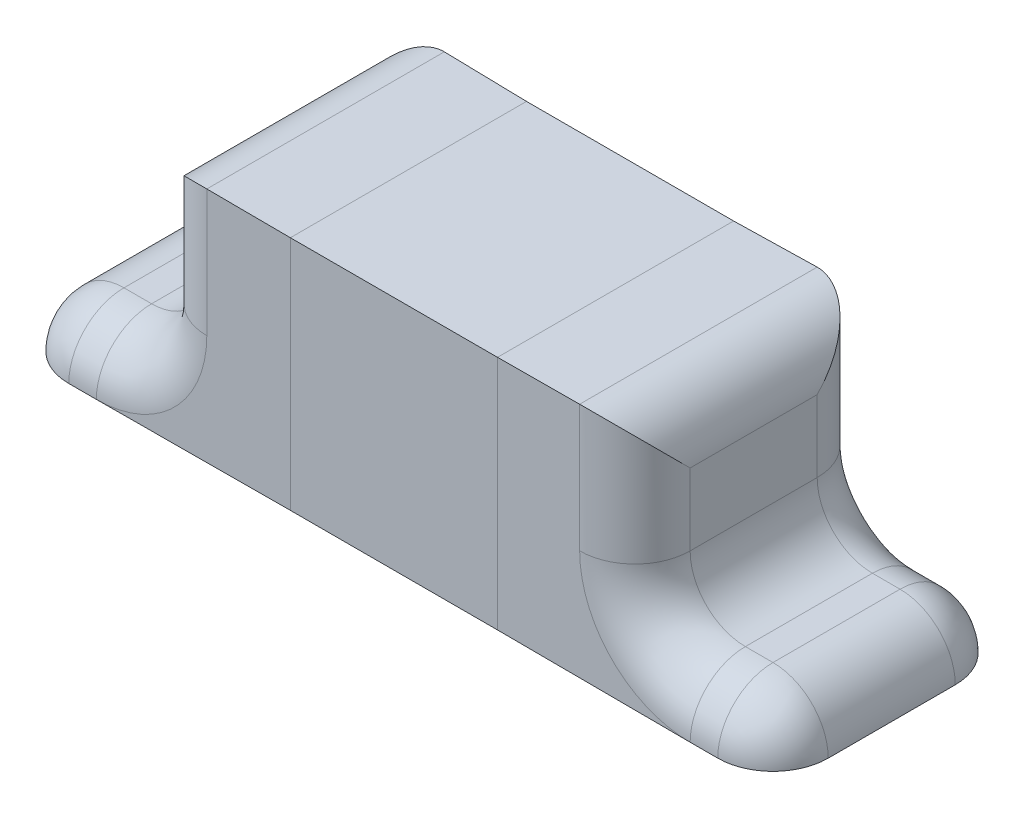
ISO-10303-21;
HEADER;
FILE_DESCRIPTION(('STEP AP214'),'2;1');
FILE_NAME('part.step','',(''),(''),'','','');
FILE_SCHEMA(('AUTOMOTIVE_DESIGN { 1 0 10303 214 1 1 1 1 }'));
ENDSEC;
DATA;
#1=APPLICATION_CONTEXT('core data for automotive mechanical design processes');
#2=APPLICATION_PROTOCOL_DEFINITION('international standard','automotive_design',2000,#1);
#3=PRODUCT_CONTEXT('',#1,'mechanical');
#4=PRODUCT('Part','Part','',(#3));
#5=PRODUCT_RELATED_PRODUCT_CATEGORY('part','',(#4));
#6=PRODUCT_DEFINITION_FORMATION('','',#4);
#7=PRODUCT_DEFINITION_CONTEXT('part definition',#1,'design');
#8=PRODUCT_DEFINITION('design','',#6,#7);
#9=PRODUCT_DEFINITION_SHAPE('','',#8);
#10=(LENGTH_UNIT() NAMED_UNIT(*) SI_UNIT(.MILLI.,.METRE.));
#11=(NAMED_UNIT(*) PLANE_ANGLE_UNIT() SI_UNIT($,.RADIAN.));
#12=(NAMED_UNIT(*) SI_UNIT($,.STERADIAN.) SOLID_ANGLE_UNIT());
#13=UNCERTAINTY_MEASURE_WITH_UNIT(LENGTH_MEASURE(1.E-05),#10,'distance_accuracy_value','');
#14=(GEOMETRIC_REPRESENTATION_CONTEXT(3) GLOBAL_UNCERTAINTY_ASSIGNED_CONTEXT((#13)) GLOBAL_UNIT_ASSIGNED_CONTEXT((#10,
#11,#12)) REPRESENTATION_CONTEXT('',''));
#15=CARTESIAN_POINT('',(0.,0.,0.));
#16=DIRECTION('',(0.,0.,1.));
#17=DIRECTION('',(1.,0.,0.));
#18=AXIS2_PLACEMENT_3D('',#15,#16,#17);
#19=CARTESIAN_POINT('',(0.875,0.,0.));
#20=DIRECTION('',(-1.,0.,0.));
#21=DIRECTION('',(0.,0.,1.));
#22=AXIS2_PLACEMENT_3D('',#19,#20,#21);
#23=PLANE('',#22);
#24=DIRECTION('',(0.,1.,0.));
#25=VECTOR('',#24,1.);
#26=CARTESIAN_POINT('',(0.875,0.,-0.23));
#27=LINE('',#26,#25);
#28=CARTESIAN_POINT('',(0.875,0.398442990090282,-0.23));
#29=VERTEX_POINT('',#28);
#30=CARTESIAN_POINT('',(0.875,0.658442990090282,-0.23));
#31=VERTEX_POINT('',#30);
#32=EDGE_CURVE('E899',#29,#31,#27,.T.);
#33=ORIENTED_EDGE('',*,*,#32,.T.);
#34=DIRECTION('',(0.,0.,1.));
#35=VECTOR('',#34,1.);
#36=CARTESIAN_POINT('',(0.875,0.658442990090282,0.));
#37=LINE('',#36,#35);
#38=CARTESIAN_POINT('',(0.875,0.658442990090282,0.23));
#39=VERTEX_POINT('',#38);
#40=EDGE_CURVE('E457',#31,#39,#37,.T.);
#41=ORIENTED_EDGE('',*,*,#40,.T.);
#42=DIRECTION('',(0.,-1.,0.));
#43=VECTOR('',#42,1.);
#44=CARTESIAN_POINT('',(0.875,0.,0.23));
#45=LINE('',#44,#43);
#46=CARTESIAN_POINT('',(0.875,0.398442990090282,0.23));
#47=VERTEX_POINT('',#46);
#48=EDGE_CURVE('E921',#39,#47,#45,.T.);
#49=ORIENTED_EDGE('',*,*,#48,.T.);
#50=DIRECTION('',(0.,0.,1.));
#51=VECTOR('',#50,1.);
#52=CARTESIAN_POINT('',(0.875,0.398442990090282,-0.43));
#53=LINE('',#52,#51);
#54=EDGE_CURVE('E252',#47,#29,#53,.F.);
#55=ORIENTED_EDGE('',*,*,#54,.T.);
#56=EDGE_LOOP('',(#33,#41,#49,#55));
#57=FACE_BOUND('',#56,.T.);
#58=ADVANCED_FACE('F41',(#57),#23,.F.);
#59=CARTESIAN_POINT('',(0.375,0.,-0.425));
#60=DIRECTION('',(0.,0.,1.));
#61=DIRECTION('',(1.,0.,0.));
#62=AXIS2_PLACEMENT_3D('',#59,#60,#61);
#63=PLANE('',#62);
#64=CARTESIAN_POINT('',(-0.375,0.,-0.425));
#65=DIRECTION('',(0.,1.,0.));
#66=VECTOR('',#65,1.);
#67=LINE('',#64,#66);
#68=CARTESIAN_POINT('',(-0.375,-0.000778504954858498,-0.4275));
#69=VERTEX_POINT('',#68);
#70=CARTESIAN_POINT('',(-0.375,0.854221495045141,-0.4275));
#71=VERTEX_POINT('',#70);
#72=EDGE_CURVE('E204',#69,#71,#67,.T.);
#73=ORIENTED_EDGE('',*,*,#72,.T.);
#74=DIRECTION('',(-1.,0.,0.));
#75=VECTOR('',#74,1.);
#76=CARTESIAN_POINT('',(0.375,0.850000000000001,-0.425));
#77=LINE('',#76,#75);
#78=CARTESIAN_POINT('',(0.375,0.854221495045141,-0.4275));
#79=VERTEX_POINT('',#78);
#80=EDGE_CURVE('E249',#79,#71,#77,.T.);
#81=ORIENTED_EDGE('',*,*,#80,.F.);
#82=CARTESIAN_POINT('',(0.375,-0.00155700990971792,-0.43));
#83=DIRECTION('',(0.,1.,0.));
#84=VECTOR('',#83,1.);
#85=LINE('',#82,#84);
#86=CARTESIAN_POINT('',(0.375,-0.000778504954858498,-0.4275));
#87=VERTEX_POINT('',#86);
#88=EDGE_CURVE('E229',#87,#79,#85,.T.);
#89=ORIENTED_EDGE('',*,*,#88,.F.);
#90=DIRECTION('',(-1.,0.,0.));
#91=VECTOR('',#90,1.);
#92=CARTESIAN_POINT('',(0.375,0.,-0.425));
#93=LINE('',#92,#91);
#94=EDGE_CURVE('E225',#87,#69,#93,.T.);
#95=ORIENTED_EDGE('',*,*,#94,.T.);
#96=EDGE_LOOP('',(#73,#81,#89,#95));
#97=FACE_BOUND('',#96,.T.);
#98=ADVANCED_FACE('F234',(#97),#63,.F.);
#99=CARTESIAN_POINT('',(0.375,0.850000000000001,0.425));
#100=DIRECTION('',(0.,-1.,0.));
#101=DIRECTION('',(0.,0.,-1.));
#102=AXIS2_PLACEMENT_3D('',#99,#100,#101);
#103=PLANE('',#102);
#104=CARTESIAN_POINT('',(-0.375,0.850000000000001,-0.425));
#105=DIRECTION('',(0.,0.,1.));
#106=VECTOR('',#105,1.);
#107=LINE('',#104,#106);
#108=CARTESIAN_POINT('',(-0.375,0.854221495045141,0.4275));
#109=VERTEX_POINT('',#108);
#110=EDGE_CURVE('E215',#71,#109,#107,.T.);
#111=ORIENTED_EDGE('',*,*,#110,.T.);
#112=DIRECTION('',(-1.,0.,0.));
#113=VECTOR('',#112,1.);
#114=CARTESIAN_POINT('',(0.375,0.850000000000001,0.425));
#115=LINE('',#114,#113);
#116=CARTESIAN_POINT('',(0.375,0.854221495045141,0.4275));
#117=VERTEX_POINT('',#116);
#118=EDGE_CURVE('E239',#117,#109,#115,.T.);
#119=ORIENTED_EDGE('',*,*,#118,.F.);
#120=CARTESIAN_POINT('',(0.375,0.858442990090282,-0.43));
#121=DIRECTION('',(0.,0.,1.));
#122=VECTOR('',#121,1.);
#123=LINE('',#120,#122);
#124=EDGE_CURVE('E260',#79,#117,#123,.T.);
#125=ORIENTED_EDGE('',*,*,#124,.F.);
#126=ORIENTED_EDGE('',*,*,#80,.T.);
#127=EDGE_LOOP('',(#111,#119,#125,#126));
#128=FACE_BOUND('',#127,.T.);
#129=ADVANCED_FACE('F266',(#128),#103,.F.);
#130=CARTESIAN_POINT('',(0.375,0.,0.425));
#131=DIRECTION('',(0.,0.,-1.));
#132=DIRECTION('',(-1.,0.,0.));
#133=AXIS2_PLACEMENT_3D('',#130,#131,#132);
#134=PLANE('',#133);
#135=CARTESIAN_POINT('',(-0.375,0.850000000000001,0.425));
#136=DIRECTION('',(0.,-1.,0.));
#137=VECTOR('',#136,1.);
#138=LINE('',#135,#137);
#139=CARTESIAN_POINT('',(-0.375,-0.000778504954858524,0.4275));
#140=VERTEX_POINT('',#139);
#141=EDGE_CURVE('E230',#109,#140,#138,.T.);
#142=ORIENTED_EDGE('',*,*,#141,.T.);
#143=DIRECTION('',(-1.,0.,0.));
#144=VECTOR('',#143,1.);
#145=CARTESIAN_POINT('',(0.375,0.,0.425));
#146=LINE('',#145,#144);
#147=CARTESIAN_POINT('',(0.375,-0.000778504954858524,0.4275));
#148=VERTEX_POINT('',#147);
#149=EDGE_CURVE('E228',#148,#140,#146,.T.);
#150=ORIENTED_EDGE('',*,*,#149,.F.);
#151=CARTESIAN_POINT('',(0.375,0.858442990090282,0.43));
#152=DIRECTION('',(0.,-1.,0.));
#153=VECTOR('',#152,1.);
#154=LINE('',#151,#153);
#155=EDGE_CURVE('E241',#117,#148,#154,.T.);
#156=ORIENTED_EDGE('',*,*,#155,.F.);
#157=ORIENTED_EDGE('',*,*,#118,.T.);
#158=EDGE_LOOP('',(#142,#150,#156,#157));
#159=FACE_BOUND('',#158,.T.);
#160=ADVANCED_FACE('F275',(#159),#134,.F.);
#161=CARTESIAN_POINT('',(0.375,0.,0.425));
#162=DIRECTION('',(0.,1.,0.));
#163=DIRECTION('',(0.,0.,1.));
#164=AXIS2_PLACEMENT_3D('',#161,#162,#163);
#165=PLANE('',#164);
#166=CARTESIAN_POINT('',(-0.375,0.,0.425));
#167=DIRECTION('',(0.,0.,-1.));
#168=VECTOR('',#167,1.);
#169=LINE('',#166,#168);
#170=EDGE_CURVE('E194',#140,#69,#169,.T.);
#171=ORIENTED_EDGE('',*,*,#170,.T.);
#172=ORIENTED_EDGE('',*,*,#94,.F.);
#173=CARTESIAN_POINT('',(0.375,-0.00155700990971797,0.43));
#174=DIRECTION('',(0.,0.,-1.));
#175=VECTOR('',#174,1.);
#176=LINE('',#173,#175);
#177=EDGE_CURVE('E237',#148,#87,#176,.T.);
#178=ORIENTED_EDGE('',*,*,#177,.F.);
#179=ORIENTED_EDGE('',*,*,#149,.T.);
#180=EDGE_LOOP('',(#171,#172,#178,#179));
#181=FACE_BOUND('',#180,.T.);
#182=ADVANCED_FACE('F223',(#181),#165,.F.);
#183=CARTESIAN_POINT('',(0.875,-0.00155700990971792,-0.43));
#184=DIRECTION('',(0.,0.,1.));
#185=DIRECTION('',(1.,0.,0.));
#186=AXIS2_PLACEMENT_3D('',#183,#184,#185);
#187=PLANE('',#186);
#188=DIRECTION('',(-1.,0.,0.));
#189=VECTOR('',#188,1.);
#190=CARTESIAN_POINT('',(0.875,0.858442990090282,-0.43));
#191=LINE('',#190,#189);
#192=CARTESIAN_POINT('',(0.675,0.858442990090282,-0.43));
#193=VERTEX_POINT('',#192);
#194=EDGE_CURVE('E216',#193,#79,#191,.T.);
#195=ORIENTED_EDGE('',*,*,#194,.F.);
#196=DIRECTION('',(0.,1.,0.));
#197=VECTOR('',#196,1.);
#198=CARTESIAN_POINT('',(0.675,-0.00155700990971792,-0.43));
#199=LINE('',#198,#197);
#200=CARTESIAN_POINT('',(0.675,0.398442990090282,-0.43));
#201=VERTEX_POINT('',#200);
#202=EDGE_CURVE('E456',#193,#201,#199,.F.);
#203=ORIENTED_EDGE('',*,*,#202,.T.);
#204=CARTESIAN_POINT('',(1.075,0.398442990090282,-0.43));
#205=DIRECTION('',(0.,0.,1.));
#206=DIRECTION('',(1.,0.,0.));
#207=AXIS2_PLACEMENT_3D('',#204,#205,#206);
#208=CIRCLE('',#207,0.4);
#209=CARTESIAN_POINT('',(1.075,-0.00155700990971792,-0.43));
#210=VERTEX_POINT('',#209);
#211=EDGE_CURVE('E453',#210,#201,#208,.F.);
#212=ORIENTED_EDGE('',*,*,#211,.F.);
#213=DIRECTION('',(-1.,0.,0.));
#214=VECTOR('',#213,1.);
#215=CARTESIAN_POINT('',(0.875,-0.00155700990971792,-0.43));
#216=LINE('',#215,#214);
#217=EDGE_CURVE('E448',#210,#87,#216,.T.);
#218=ORIENTED_EDGE('',*,*,#217,.T.);
#219=ORIENTED_EDGE('',*,*,#88,.T.);
#220=EDGE_LOOP('',(#195,#203,#212,#218,#219));
#221=FACE_BOUND('',#220,.T.);
#222=ADVANCED_FACE('F424',(#221),#187,.F.);
#223=CARTESIAN_POINT('',(0.875,0.858442990090282,0.43));
#224=DIRECTION('',(0.,-1.,0.));
#225=DIRECTION('',(0.,0.,-1.));
#226=AXIS2_PLACEMENT_3D('',#223,#224,#225);
#227=PLANE('',#226);
#228=DIRECTION('',(-1.,0.,0.));
#229=VECTOR('',#228,1.);
#230=CARTESIAN_POINT('',(0.875,0.858442990090282,0.43));
#231=LINE('',#230,#229);
#232=CARTESIAN_POINT('',(0.675,0.858442990090282,0.43));
#233=VERTEX_POINT('',#232);
#234=EDGE_CURVE('E402',#233,#117,#231,.T.);
#235=ORIENTED_EDGE('',*,*,#234,.F.);
#236=DIRECTION('',(0.,0.,1.));
#237=VECTOR('',#236,1.);
#238=CARTESIAN_POINT('',(0.675,0.858442990090282,0.43));
#239=LINE('',#238,#237);
#240=EDGE_CURVE('E914',#233,#193,#239,.F.);
#241=ORIENTED_EDGE('',*,*,#240,.T.);
#242=ORIENTED_EDGE('',*,*,#194,.T.);
#243=ORIENTED_EDGE('',*,*,#124,.T.);
#244=EDGE_LOOP('',(#235,#241,#242,#243));
#245=FACE_BOUND('',#244,.T.);
#246=ADVANCED_FACE('F401',(#245),#227,.F.);
#247=CARTESIAN_POINT('',(0.875,-0.00155700990971797,0.43));
#248=DIRECTION('',(0.,0.,-1.));
#249=DIRECTION('',(-1.,0.,0.));
#250=AXIS2_PLACEMENT_3D('',#247,#248,#249);
#251=PLANE('',#250);
#252=CARTESIAN_POINT('',(1.075,0.398442990090282,0.43));
#253=DIRECTION('',(0.,0.,-1.));
#254=DIRECTION('',(-1.,0.,0.));
#255=AXIS2_PLACEMENT_3D('',#252,#253,#254);
#256=CIRCLE('',#255,0.4);
#257=CARTESIAN_POINT('',(0.675,0.398442990090282,0.43));
#258=VERTEX_POINT('',#257);
#259=CARTESIAN_POINT('',(1.075,-0.00155700990971797,0.43));
#260=VERTEX_POINT('',#259);
#261=EDGE_CURVE('E460',#258,#260,#256,.F.);
#262=ORIENTED_EDGE('',*,*,#261,.F.);
#263=DIRECTION('',(0.,-1.,0.));
#264=VECTOR('',#263,1.);
#265=CARTESIAN_POINT('',(0.675,-0.00155700990971797,0.43));
#266=LINE('',#265,#264);
#267=EDGE_CURVE('E916',#258,#233,#266,.F.);
#268=ORIENTED_EDGE('',*,*,#267,.T.);
#269=ORIENTED_EDGE('',*,*,#234,.T.);
#270=ORIENTED_EDGE('',*,*,#155,.T.);
#271=DIRECTION('',(-1.,0.,0.));
#272=VECTOR('',#271,1.);
#273=CARTESIAN_POINT('',(0.875,-0.00155700990971797,0.43));
#274=LINE('',#273,#272);
#275=EDGE_CURVE('E461',#260,#148,#274,.T.);
#276=ORIENTED_EDGE('',*,*,#275,.F.);
#277=EDGE_LOOP('',(#262,#268,#269,#270,#276));
#278=FACE_BOUND('',#277,.T.);
#279=ADVANCED_FACE('F423',(#278),#251,.F.);
#280=CARTESIAN_POINT('',(0.875,-0.00155700990971797,0.43));
#281=DIRECTION('',(0.,1.,0.));
#282=DIRECTION('',(0.,0.,1.));
#283=AXIS2_PLACEMENT_3D('',#280,#281,#282);
#284=PLANE('',#283);
#285=CARTESIAN_POINT('',(1.175,-0.00155700990971792,-0.43));
#286=VERTEX_POINT('',#285);
#287=EDGE_CURVE('E444',#286,#210,#216,.T.);
#288=ORIENTED_EDGE('',*,*,#287,.F.);
#289=CARTESIAN_POINT('',(1.175,-0.00155700990971793,-0.23));
#290=DIRECTION('',(0.,1.,0.));
#291=DIRECTION('',(0.,0.,1.));
#292=AXIS2_PLACEMENT_3D('',#289,#290,#291);
#293=CIRCLE('',#292,0.2);
#294=CARTESIAN_POINT('',(1.375,-0.00155700990971797,-0.23));
#295=VERTEX_POINT('',#294);
#296=EDGE_CURVE('E478',#286,#295,#293,.F.);
#297=ORIENTED_EDGE('',*,*,#296,.T.);
#298=DIRECTION('',(0.,0.,-1.));
#299=VECTOR('',#298,1.);
#300=CARTESIAN_POINT('',(1.375,-0.00155700990971797,0.43));
#301=LINE('',#300,#299);
#302=CARTESIAN_POINT('',(1.375,-0.00155700990971797,0.23));
#303=VERTEX_POINT('',#302);
#304=EDGE_CURVE('E451',#303,#295,#301,.T.);
#305=ORIENTED_EDGE('',*,*,#304,.F.);
#306=CARTESIAN_POINT('',(1.175,-0.00155700990971796,0.23));
#307=DIRECTION('',(0.,1.,0.));
#308=DIRECTION('',(0.,0.,1.));
#309=AXIS2_PLACEMENT_3D('',#306,#307,#308);
#310=CIRCLE('',#309,0.2);
#311=CARTESIAN_POINT('',(1.175,-0.00155700990971797,0.43));
#312=VERTEX_POINT('',#311);
#313=EDGE_CURVE('E476',#303,#312,#310,.F.);
#314=ORIENTED_EDGE('',*,*,#313,.T.);
#315=EDGE_CURVE('E464',#312,#260,#274,.T.);
#316=ORIENTED_EDGE('',*,*,#315,.T.);
#317=ORIENTED_EDGE('',*,*,#275,.T.);
#318=ORIENTED_EDGE('',*,*,#177,.T.);
#319=ORIENTED_EDGE('',*,*,#217,.F.);
#320=EDGE_LOOP('',(#288,#297,#305,#314,#316,#317,#318,#319));
#321=FACE_BOUND('',#320,.T.);
#322=ADVANCED_FACE('F548',(#321),#284,.F.);
#323=CARTESIAN_POINT('',(1.375,0.198442990090282,0.43));
#324=DIRECTION('',(0.,-1.,0.));
#325=DIRECTION('',(0.,0.,-1.));
#326=AXIS2_PLACEMENT_3D('',#323,#324,#325);
#327=PLANE('',#326);
#328=DIRECTION('',(-1.,0.,0.));
#329=VECTOR('',#328,1.);
#330=CARTESIAN_POINT('',(1.375,0.198442990090282,-0.23));
#331=LINE('',#330,#329);
#332=CARTESIAN_POINT('',(1.175,0.198442990090282,-0.23));
#333=VERTEX_POINT('',#332);
#334=CARTESIAN_POINT('',(1.075,0.198442990090282,-0.23));
#335=VERTEX_POINT('',#334);
#336=EDGE_CURVE('E906',#333,#335,#331,.T.);
#337=ORIENTED_EDGE('',*,*,#336,.T.);
#338=DIRECTION('',(0.,0.,1.));
#339=VECTOR('',#338,1.);
#340=CARTESIAN_POINT('',(1.075,0.198442990090282,0.43));
#341=LINE('',#340,#339);
#342=CARTESIAN_POINT('',(1.075,0.198442990090282,0.23));
#343=VERTEX_POINT('',#342);
#344=EDGE_CURVE('E904',#335,#343,#341,.T.);
#345=ORIENTED_EDGE('',*,*,#344,.T.);
#346=DIRECTION('',(-1.,0.,0.));
#347=VECTOR('',#346,1.);
#348=CARTESIAN_POINT('',(1.375,0.198442990090282,0.23));
#349=LINE('',#348,#347);
#350=CARTESIAN_POINT('',(1.175,0.198442990090282,0.23));
#351=VERTEX_POINT('',#350);
#352=EDGE_CURVE('E909',#343,#351,#349,.F.);
#353=ORIENTED_EDGE('',*,*,#352,.T.);
#354=DIRECTION('',(0.,0.,1.));
#355=VECTOR('',#354,1.);
#356=CARTESIAN_POINT('',(1.175,0.198442990090282,0.43));
#357=LINE('',#356,#355);
#358=EDGE_CURVE('E911',#351,#333,#357,.F.);
#359=ORIENTED_EDGE('',*,*,#358,.T.);
#360=EDGE_LOOP('',(#337,#345,#353,#359));
#361=FACE_BOUND('',#360,.T.);
#362=ADVANCED_FACE('F547',(#361),#327,.F.);
#363=CARTESIAN_POINT('',(0.875,-0.00155700990971797,0.23));
#364=DIRECTION('',(-1.,0.,0.));
#365=DIRECTION('',(0.,0.,1.));
#366=AXIS2_PLACEMENT_3D('',#363,#364,#365);
#367=CYLINDRICAL_SURFACE('',#366,0.2);
#368=ORIENTED_EDGE('',*,*,#315,.F.);
#369=CARTESIAN_POINT('',(1.175,-0.00155700990971797,0.23));
#370=DIRECTION('',(-1.,0.,0.));
#371=DIRECTION('',(0.,0.,1.));
#372=AXIS2_PLACEMENT_3D('',#369,#370,#371);
#373=CIRCLE('',#372,0.2);
#374=EDGE_CURVE('E485',#312,#351,#373,.T.);
#375=ORIENTED_EDGE('',*,*,#374,.T.);
#376=ORIENTED_EDGE('',*,*,#352,.F.);
#377=CARTESIAN_POINT('',(1.075,-0.00155700990971797,0.23));
#378=DIRECTION('',(-1.,0.,0.));
#379=DIRECTION('',(0.,0.,1.));
#380=AXIS2_PLACEMENT_3D('',#377,#378,#379);
#381=CIRCLE('',#380,0.2);
#382=EDGE_CURVE('E597',#260,#343,#381,.T.);
#383=ORIENTED_EDGE('',*,*,#382,.F.);
#384=EDGE_LOOP('',(#368,#375,#376,#383));
#385=FACE_BOUND('',#384,.T.);
#386=ADVANCED_FACE('F563',(#385),#367,.T.);
#387=CARTESIAN_POINT('',(1.175,-0.00155700990971797,0.));
#388=DIRECTION('',(0.,0.,1.));
#389=DIRECTION('',(1.,0.,0.));
#390=AXIS2_PLACEMENT_3D('',#387,#388,#389);
#391=CYLINDRICAL_SURFACE('',#390,0.2);
#392=ORIENTED_EDGE('',*,*,#304,.T.);
#393=CARTESIAN_POINT('',(1.175,-0.00155700990971797,-0.23));
#394=DIRECTION('',(0.,0.,1.));
#395=DIRECTION('',(1.,0.,0.));
#396=AXIS2_PLACEMENT_3D('',#393,#394,#395);
#397=CIRCLE('',#396,0.2);
#398=EDGE_CURVE('E483',#295,#333,#397,.T.);
#399=ORIENTED_EDGE('',*,*,#398,.T.);
#400=ORIENTED_EDGE('',*,*,#358,.F.);
#401=CARTESIAN_POINT('',(1.175,-0.00155700990971797,0.23));
#402=DIRECTION('',(0.,0.,1.));
#403=DIRECTION('',(1.,0.,0.));
#404=AXIS2_PLACEMENT_3D('',#401,#402,#403);
#405=CIRCLE('',#404,0.2);
#406=EDGE_CURVE('E480',#351,#303,#405,.F.);
#407=ORIENTED_EDGE('',*,*,#406,.T.);
#408=EDGE_LOOP('',(#392,#399,#400,#407));
#409=FACE_BOUND('',#408,.T.);
#410=ADVANCED_FACE('F864',(#409),#391,.T.);
#411=CARTESIAN_POINT('',(1.075,0.398442990090282,0.23));
#412=DIRECTION('',(0.,0.,-1.));
#413=DIRECTION('',(-1.,0.,0.));
#414=AXIS2_PLACEMENT_3D('',#411,#412,#413);
#415=TOROIDAL_SURFACE('',#414,0.4,0.2);
#416=ORIENTED_EDGE('',*,*,#261,.T.);
#417=ORIENTED_EDGE('',*,*,#382,.T.);
#418=CARTESIAN_POINT('',(1.075,0.398442990090282,0.23));
#419=DIRECTION('',(0.,0.,-1.));
#420=DIRECTION('',(-1.,0.,0.));
#421=AXIS2_PLACEMENT_3D('',#418,#419,#420);
#422=CIRCLE('',#421,0.2);
#423=EDGE_CURVE('E590',#47,#343,#422,.F.);
#424=ORIENTED_EDGE('',*,*,#423,.F.);
#425=CARTESIAN_POINT('',(0.675,0.398442990090282,0.23));
#426=DIRECTION('',(0.,-1.,0.));
#427=DIRECTION('',(0.,0.,-1.));
#428=AXIS2_PLACEMENT_3D('',#425,#426,#427);
#429=CIRCLE('',#428,0.2);
#430=EDGE_CURVE('E587',#258,#47,#429,.F.);
#431=ORIENTED_EDGE('',*,*,#430,.F.);
#432=EDGE_LOOP('',(#416,#417,#424,#431));
#433=FACE_BOUND('',#432,.T.);
#434=ADVANCED_FACE('F855',(#433),#415,.T.);
#435=CARTESIAN_POINT('',(1.375,-0.00155700990971797,-0.23));
#436=DIRECTION('',(-1.,0.,0.));
#437=DIRECTION('',(0.,0.,1.));
#438=AXIS2_PLACEMENT_3D('',#435,#436,#437);
#439=CYLINDRICAL_SURFACE('',#438,0.2);
#440=ORIENTED_EDGE('',*,*,#336,.F.);
#441=CARTESIAN_POINT('',(1.175,-0.00155700990971797,-0.23));
#442=DIRECTION('',(-1.,0.,0.));
#443=DIRECTION('',(0.,0.,1.));
#444=AXIS2_PLACEMENT_3D('',#441,#442,#443);
#445=CIRCLE('',#444,0.2);
#446=EDGE_CURVE('E475',#333,#286,#445,.T.);
#447=ORIENTED_EDGE('',*,*,#446,.T.);
#448=ORIENTED_EDGE('',*,*,#287,.T.);
#449=CARTESIAN_POINT('',(1.075,-0.00155700990971797,-0.23));
#450=DIRECTION('',(-1.,0.,0.));
#451=DIRECTION('',(0.,0.,1.));
#452=AXIS2_PLACEMENT_3D('',#449,#450,#451);
#453=CIRCLE('',#452,0.2);
#454=EDGE_CURVE('E576',#335,#210,#453,.T.);
#455=ORIENTED_EDGE('',*,*,#454,.F.);
#456=EDGE_LOOP('',(#440,#447,#448,#455));
#457=FACE_BOUND('',#456,.T.);
#458=ADVANCED_FACE('F575',(#457),#439,.T.);
#459=CARTESIAN_POINT('',(1.075,0.398442990090282,0.43));
#460=DIRECTION('',(0.,0.,-1.));
#461=DIRECTION('',(-1.,0.,0.));
#462=AXIS2_PLACEMENT_3D('',#459,#460,#461);
#463=CYLINDRICAL_SURFACE('',#462,0.2);
#464=ORIENTED_EDGE('',*,*,#423,.T.);
#465=ORIENTED_EDGE('',*,*,#344,.F.);
#466=CARTESIAN_POINT('',(1.075,0.398442990090282,-0.23));
#467=DIRECTION('',(0.,0.,1.));
#468=DIRECTION('',(1.,0.,0.));
#469=AXIS2_PLACEMENT_3D('',#466,#467,#468);
#470=CIRCLE('',#469,0.2);
#471=EDGE_CURVE('E586',#29,#335,#470,.T.);
#472=ORIENTED_EDGE('',*,*,#471,.F.);
#473=ORIENTED_EDGE('',*,*,#54,.F.);
#474=EDGE_LOOP('',(#464,#465,#472,#473));
#475=FACE_BOUND('',#474,.T.);
#476=ADVANCED_FACE('F854',(#475),#463,.F.);
#477=CARTESIAN_POINT('',(0.675,0.,0.23));
#478=DIRECTION('',(0.,-1.,0.));
#479=DIRECTION('',(0.,0.,-1.));
#480=AXIS2_PLACEMENT_3D('',#477,#478,#479);
#481=CYLINDRICAL_SURFACE('',#480,0.2);
#482=ORIENTED_EDGE('',*,*,#430,.T.);
#483=ORIENTED_EDGE('',*,*,#48,.F.);
#484=CARTESIAN_POINT('',(0.675,0.658442990090282,0.23));
#485=DIRECTION('',(0.,-0.707106781186547,0.707106781186547));
#486=DIRECTION('',(0.,0.707106781186547,0.707106781186547));
#487=AXIS2_PLACEMENT_3D('',#484,#485,#486);
#488=ELLIPSE('',#487,0.282842712474619,0.2);
#489=EDGE_CURVE('E592',#233,#39,#488,.F.);
#490=ORIENTED_EDGE('',*,*,#489,.F.);
#491=ORIENTED_EDGE('',*,*,#267,.F.);
#492=EDGE_LOOP('',(#482,#483,#490,#491));
#493=FACE_BOUND('',#492,.T.);
#494=ADVANCED_FACE('F886',(#493),#481,.T.);
#495=CARTESIAN_POINT('',(1.075,0.398442990090282,-0.23));
#496=DIRECTION('',(0.,0.,1.));
#497=DIRECTION('',(1.,0.,0.));
#498=AXIS2_PLACEMENT_3D('',#495,#496,#497);
#499=TOROIDAL_SURFACE('',#498,0.4,0.2);
#500=ORIENTED_EDGE('',*,*,#454,.T.);
#501=ORIENTED_EDGE('',*,*,#211,.T.);
#502=CARTESIAN_POINT('',(0.675,0.398442990090282,-0.23));
#503=DIRECTION('',(0.,-1.,0.));
#504=DIRECTION('',(0.,0.,-1.));
#505=AXIS2_PLACEMENT_3D('',#502,#503,#504);
#506=CIRCLE('',#505,0.2);
#507=EDGE_CURVE('E583',#29,#201,#506,.F.);
#508=ORIENTED_EDGE('',*,*,#507,.F.);
#509=ORIENTED_EDGE('',*,*,#471,.T.);
#510=EDGE_LOOP('',(#500,#501,#508,#509));
#511=FACE_BOUND('',#510,.T.);
#512=ADVANCED_FACE('F582',(#511),#499,.T.);
#513=CARTESIAN_POINT('',(0.675,0.658442990090282,0.));
#514=DIRECTION('',(0.,0.,1.));
#515=DIRECTION('',(1.,0.,0.));
#516=AXIS2_PLACEMENT_3D('',#513,#514,#515);
#517=CYLINDRICAL_SURFACE('',#516,0.2);
#518=ORIENTED_EDGE('',*,*,#489,.T.);
#519=ORIENTED_EDGE('',*,*,#40,.F.);
#520=CARTESIAN_POINT('',(0.675,0.658442990090282,-0.23));
#521=DIRECTION('',(0.,0.707106781186547,0.707106781186547));
#522=DIRECTION('',(0.,-0.707106781186547,0.707106781186547));
#523=AXIS2_PLACEMENT_3D('',#520,#521,#522);
#524=ELLIPSE('',#523,0.282842712474619,0.2);
#525=EDGE_CURVE('E305',#193,#31,#524,.F.);
#526=ORIENTED_EDGE('',*,*,#525,.F.);
#527=ORIENTED_EDGE('',*,*,#240,.F.);
#528=EDGE_LOOP('',(#518,#519,#526,#527));
#529=FACE_BOUND('',#528,.T.);
#530=ADVANCED_FACE('F893',(#529),#517,.T.);
#531=CARTESIAN_POINT('',(0.675,0.,-0.23));
#532=DIRECTION('',(0.,1.,0.));
#533=DIRECTION('',(0.,0.,1.));
#534=AXIS2_PLACEMENT_3D('',#531,#532,#533);
#535=CYLINDRICAL_SURFACE('',#534,0.2);
#536=ORIENTED_EDGE('',*,*,#507,.T.);
#537=ORIENTED_EDGE('',*,*,#202,.F.);
#538=ORIENTED_EDGE('',*,*,#525,.T.);
#539=ORIENTED_EDGE('',*,*,#32,.F.);
#540=EDGE_LOOP('',(#536,#537,#538,#539));
#541=FACE_BOUND('',#540,.T.);
#542=ADVANCED_FACE('F643',(#541),#535,.T.);
#543=CARTESIAN_POINT('',(1.175,-0.00155700990971797,-0.23));
#544=DIRECTION('',(0.,0.,1.));
#545=DIRECTION('',(1.,0.,0.));
#546=AXIS2_PLACEMENT_3D('',#543,#544,#545);
#547=SPHERICAL_SURFACE('',#546,0.2);
#548=ORIENTED_EDGE('',*,*,#446,.F.);
#549=ORIENTED_EDGE('',*,*,#398,.F.);
#550=ORIENTED_EDGE('',*,*,#296,.F.);
#551=EDGE_LOOP('',(#548,#549,#550));
#552=FACE_BOUND('',#551,.T.);
#553=ADVANCED_FACE('F637',(#552),#547,.T.);
#554=CARTESIAN_POINT('',(1.175,-0.00155700990971797,0.23));
#555=DIRECTION('',(0.,0.,1.));
#556=DIRECTION('',(1.,0.,0.));
#557=AXIS2_PLACEMENT_3D('',#554,#555,#556);
#558=SPHERICAL_SURFACE('',#557,0.2);
#559=ORIENTED_EDGE('',*,*,#406,.F.);
#560=ORIENTED_EDGE('',*,*,#374,.F.);
#561=ORIENTED_EDGE('',*,*,#313,.F.);
#562=EDGE_LOOP('',(#559,#560,#561));
#563=FACE_BOUND('',#562,.T.);
#564=ADVANCED_FACE('F633',(#563),#558,.T.);
#565=CARTESIAN_POINT('',(-0.875,-0.00155700990971792,-0.43));
#566=DIRECTION('',(0.,0.,-1.));
#567=DIRECTION('',(-1.,0.,0.));
#568=AXIS2_PLACEMENT_3D('',#565,#566,#567);
#569=PLANE('',#568);
#570=CARTESIAN_POINT('',(-1.075,0.398442990090282,-0.43));
#571=DIRECTION('',(0.,0.,-1.));
#572=DIRECTION('',(-1.,0.,0.));
#573=AXIS2_PLACEMENT_3D('',#570,#571,#572);
#574=CIRCLE('',#573,0.4);
#575=CARTESIAN_POINT('',(-0.675,0.398442990090282,-0.43));
#576=VERTEX_POINT('',#575);
#577=CARTESIAN_POINT('',(-1.075,-0.00155700990971792,-0.43));
#578=VERTEX_POINT('',#577);
#579=EDGE_CURVE('E486',#576,#578,#574,.T.);
#580=ORIENTED_EDGE('',*,*,#579,.F.);
#581=DIRECTION('',(0.,1.,0.));
#582=VECTOR('',#581,1.);
#583=CARTESIAN_POINT('',(-0.675,0.858442990090282,-0.43));
#584=LINE('',#583,#582);
#585=CARTESIAN_POINT('',(-0.675,0.858442990090282,-0.43));
#586=VERTEX_POINT('',#585);
#587=EDGE_CURVE('E500',#576,#586,#584,.T.);
#588=ORIENTED_EDGE('',*,*,#587,.T.);
#589=DIRECTION('',(1.,0.,0.));
#590=VECTOR('',#589,1.);
#591=CARTESIAN_POINT('',(-0.875,0.858442990090282,-0.43));
#592=LINE('',#591,#590);
#593=EDGE_CURVE('E209',#586,#71,#592,.T.);
#594=ORIENTED_EDGE('',*,*,#593,.T.);
#595=ORIENTED_EDGE('',*,*,#72,.F.);
#596=DIRECTION('',(1.,0.,0.));
#597=VECTOR('',#596,1.);
#598=CARTESIAN_POINT('',(-0.875,-0.00155700990971792,-0.43));
#599=LINE('',#598,#597);
#600=EDGE_CURVE('E189',#578,#69,#599,.T.);
#601=ORIENTED_EDGE('',*,*,#600,.F.);
#602=EDGE_LOOP('',(#580,#588,#594,#595,#601));
#603=FACE_BOUND('',#602,.T.);
#604=ADVANCED_FACE('F206',(#603),#569,.T.);
#605=CARTESIAN_POINT('',(-0.875,-0.00155700990971797,0.43));
#606=DIRECTION('',(0.,-1.,0.));
#607=DIRECTION('',(0.,0.,-1.));
#608=AXIS2_PLACEMENT_3D('',#605,#606,#607);
#609=PLANE('',#608);
#610=DIRECTION('',(0.,0.,-1.));
#611=VECTOR('',#610,1.);
#612=CARTESIAN_POINT('',(-1.375,-0.00155700990971797,0.43));
#613=LINE('',#612,#611);
#614=CARTESIAN_POINT('',(-1.375,-0.00155700990971797,0.23));
#615=VERTEX_POINT('',#614);
#616=CARTESIAN_POINT('',(-1.375,-0.00155700990971797,-0.23));
#617=VERTEX_POINT('',#616);
#618=EDGE_CURVE('E375',#615,#617,#613,.T.);
#619=ORIENTED_EDGE('',*,*,#618,.T.);
#620=CARTESIAN_POINT('',(-1.175,-0.00155700990971793,-0.23));
#621=DIRECTION('',(0.,-1.,0.));
#622=DIRECTION('',(0.,0.,-1.));
#623=AXIS2_PLACEMENT_3D('',#620,#621,#622);
#624=CIRCLE('',#623,0.2);
#625=CARTESIAN_POINT('',(-1.175,-0.00155700990971792,-0.43));
#626=VERTEX_POINT('',#625);
#627=EDGE_CURVE('E49',#617,#626,#624,.T.);
#628=ORIENTED_EDGE('',*,*,#627,.T.);
#629=EDGE_CURVE('E198',#626,#578,#599,.T.);
#630=ORIENTED_EDGE('',*,*,#629,.T.);
#631=ORIENTED_EDGE('',*,*,#600,.T.);
#632=ORIENTED_EDGE('',*,*,#170,.F.);
#633=DIRECTION('',(1.,0.,0.));
#634=VECTOR('',#633,1.);
#635=CARTESIAN_POINT('',(-0.875,-0.00155700990971797,0.43));
#636=LINE('',#635,#634);
#637=CARTESIAN_POINT('',(-1.075,-0.00155700990971797,0.43));
#638=VERTEX_POINT('',#637);
#639=EDGE_CURVE('E319',#638,#140,#636,.T.);
#640=ORIENTED_EDGE('',*,*,#639,.F.);
#641=CARTESIAN_POINT('',(-1.175,-0.00155700990971797,0.43));
#642=VERTEX_POINT('',#641);
#643=EDGE_CURVE('E201',#642,#638,#636,.T.);
#644=ORIENTED_EDGE('',*,*,#643,.F.);
#645=CARTESIAN_POINT('',(-1.175,-0.00155700990971796,0.23));
#646=DIRECTION('',(0.,-1.,0.));
#647=DIRECTION('',(0.,0.,-1.));
#648=AXIS2_PLACEMENT_3D('',#645,#646,#647);
#649=CIRCLE('',#648,0.2);
#650=EDGE_CURVE('E316',#642,#615,#649,.T.);
#651=ORIENTED_EDGE('',*,*,#650,.T.);
#652=EDGE_LOOP('',(#619,#628,#630,#631,#632,#640,#644,#651));
#653=FACE_BOUND('',#652,.T.);
#654=ADVANCED_FACE('F191',(#653),#609,.T.);
#655=CARTESIAN_POINT('',(-0.875,-0.00155700990971797,0.43));
#656=DIRECTION('',(0.,0.,1.));
#657=DIRECTION('',(1.,0.,0.));
#658=AXIS2_PLACEMENT_3D('',#655,#656,#657);
#659=PLANE('',#658);
#660=DIRECTION('',(1.,0.,0.));
#661=VECTOR('',#660,1.);
#662=CARTESIAN_POINT('',(-0.875,0.858442990090282,0.43));
#663=LINE('',#662,#661);
#664=CARTESIAN_POINT('',(-0.675,0.858442990090282,0.43));
#665=VERTEX_POINT('',#664);
#666=EDGE_CURVE('E332',#665,#109,#663,.T.);
#667=ORIENTED_EDGE('',*,*,#666,.F.);
#668=DIRECTION('',(0.,-1.,0.));
#669=VECTOR('',#668,1.);
#670=CARTESIAN_POINT('',(-0.675,0.198442990090282,0.43));
#671=LINE('',#670,#669);
#672=CARTESIAN_POINT('',(-0.675,0.398442990090282,0.43));
#673=VERTEX_POINT('',#672);
#674=EDGE_CURVE('E338',#665,#673,#671,.T.);
#675=ORIENTED_EDGE('',*,*,#674,.T.);
#676=CARTESIAN_POINT('',(-1.075,0.398442990090282,0.43));
#677=DIRECTION('',(0.,0.,1.));
#678=DIRECTION('',(1.,0.,0.));
#679=AXIS2_PLACEMENT_3D('',#676,#677,#678);
#680=CIRCLE('',#679,0.4);
#681=EDGE_CURVE('E335',#638,#673,#680,.T.);
#682=ORIENTED_EDGE('',*,*,#681,.F.);
#683=ORIENTED_EDGE('',*,*,#639,.T.);
#684=ORIENTED_EDGE('',*,*,#141,.F.);
#685=EDGE_LOOP('',(#667,#675,#682,#683,#684));
#686=FACE_BOUND('',#685,.T.);
#687=ADVANCED_FACE('F386',(#686),#659,.T.);
#688=CARTESIAN_POINT('',(-0.875,0.858442990090282,0.43));
#689=DIRECTION('',(0.,1.,0.));
#690=DIRECTION('',(0.,0.,1.));
#691=AXIS2_PLACEMENT_3D('',#688,#689,#690);
#692=PLANE('',#691);
#693=ORIENTED_EDGE('',*,*,#593,.F.);
#694=DIRECTION('',(0.,0.,1.));
#695=VECTOR('',#694,1.);
#696=CARTESIAN_POINT('',(-0.675,0.858442990090282,0.43));
#697=LINE('',#696,#695);
#698=EDGE_CURVE('E341',#586,#665,#697,.T.);
#699=ORIENTED_EDGE('',*,*,#698,.T.);
#700=ORIENTED_EDGE('',*,*,#666,.T.);
#701=ORIENTED_EDGE('',*,*,#110,.F.);
#702=EDGE_LOOP('',(#693,#699,#700,#701));
#703=FACE_BOUND('',#702,.T.);
#704=ADVANCED_FACE('F381',(#703),#692,.T.);
#705=CARTESIAN_POINT('',(-0.875,0.,0.));
#706=DIRECTION('',(1.,0.,0.));
#707=DIRECTION('',(0.,0.,1.));
#708=AXIS2_PLACEMENT_3D('',#705,#706,#707);
#709=PLANE('',#708);
#710=DIRECTION('',(0.,-1.,0.));
#711=VECTOR('',#710,1.);
#712=CARTESIAN_POINT('',(-0.875,0.858442990090282,0.23));
#713=LINE('',#712,#711);
#714=CARTESIAN_POINT('',(-0.875,0.398442990090282,0.23));
#715=VERTEX_POINT('',#714);
#716=CARTESIAN_POINT('',(-0.875,0.658442990090282,0.23));
#717=VERTEX_POINT('',#716);
#718=EDGE_CURVE('E507',#715,#717,#713,.F.);
#719=ORIENTED_EDGE('',*,*,#718,.T.);
#720=DIRECTION('',(0.,0.,1.));
#721=VECTOR('',#720,1.);
#722=CARTESIAN_POINT('',(-0.875,0.658442990090282,-0.43));
#723=LINE('',#722,#721);
#724=CARTESIAN_POINT('',(-0.875,0.658442990090282,-0.23));
#725=VERTEX_POINT('',#724);
#726=EDGE_CURVE('E339',#717,#725,#723,.F.);
#727=ORIENTED_EDGE('',*,*,#726,.T.);
#728=DIRECTION('',(0.,1.,0.));
#729=VECTOR('',#728,1.);
#730=CARTESIAN_POINT('',(-0.875,0.198442990090282,-0.23));
#731=LINE('',#730,#729);
#732=CARTESIAN_POINT('',(-0.875,0.398442990090282,-0.23));
#733=VERTEX_POINT('',#732);
#734=EDGE_CURVE('E509',#725,#733,#731,.F.);
#735=ORIENTED_EDGE('',*,*,#734,.T.);
#736=DIRECTION('',(0.,0.,1.));
#737=VECTOR('',#736,1.);
#738=CARTESIAN_POINT('',(-0.875,0.398442990090282,0.));
#739=LINE('',#738,#737);
#740=EDGE_CURVE('E503',#733,#715,#739,.T.);
#741=ORIENTED_EDGE('',*,*,#740,.T.);
#742=EDGE_LOOP('',(#719,#727,#735,#741));
#743=FACE_BOUND('',#742,.T.);
#744=ADVANCED_FACE('F514',(#743),#709,.F.);
#745=CARTESIAN_POINT('',(-1.375,0.198442990090282,0.43));
#746=DIRECTION('',(0.,1.,0.));
#747=DIRECTION('',(0.,0.,1.));
#748=AXIS2_PLACEMENT_3D('',#745,#746,#747);
#749=PLANE('',#748);
#750=DIRECTION('',(1.,0.,0.));
#751=VECTOR('',#750,1.);
#752=CARTESIAN_POINT('',(-1.375,0.198442990090282,0.23));
#753=LINE('',#752,#751);
#754=CARTESIAN_POINT('',(-1.175,0.198442990090282,0.23));
#755=VERTEX_POINT('',#754);
#756=CARTESIAN_POINT('',(-1.075,0.198442990090282,0.23));
#757=VERTEX_POINT('',#756);
#758=EDGE_CURVE('E346',#755,#757,#753,.T.);
#759=ORIENTED_EDGE('',*,*,#758,.T.);
#760=DIRECTION('',(0.,0.,1.));
#761=VECTOR('',#760,1.);
#762=CARTESIAN_POINT('',(-1.075,0.198442990090282,0.43));
#763=LINE('',#762,#761);
#764=CARTESIAN_POINT('',(-1.075,0.198442990090282,-0.23));
#765=VERTEX_POINT('',#764);
#766=EDGE_CURVE('E312',#757,#765,#763,.F.);
#767=ORIENTED_EDGE('',*,*,#766,.T.);
#768=DIRECTION('',(1.,0.,0.));
#769=VECTOR('',#768,1.);
#770=CARTESIAN_POINT('',(-1.375,0.198442990090282,-0.23));
#771=LINE('',#770,#769);
#772=CARTESIAN_POINT('',(-1.175,0.198442990090282,-0.23));
#773=VERTEX_POINT('',#772);
#774=EDGE_CURVE('E348',#765,#773,#771,.F.);
#775=ORIENTED_EDGE('',*,*,#774,.T.);
#776=DIRECTION('',(0.,0.,1.));
#777=VECTOR('',#776,1.);
#778=CARTESIAN_POINT('',(-1.175,0.198442990090282,0.43));
#779=LINE('',#778,#777);
#780=EDGE_CURVE('E343',#773,#755,#779,.T.);
#781=ORIENTED_EDGE('',*,*,#780,.T.);
#782=EDGE_LOOP('',(#759,#767,#775,#781));
#783=FACE_BOUND('',#782,.T.);
#784=ADVANCED_FACE('F674',(#783),#749,.T.);
#785=CARTESIAN_POINT('',(-1.375,-0.00155700990971797,0.23));
#786=DIRECTION('',(1.,0.,0.));
#787=DIRECTION('',(0.,0.,-1.));
#788=AXIS2_PLACEMENT_3D('',#785,#786,#787);
#789=CYLINDRICAL_SURFACE('',#788,0.2);
#790=ORIENTED_EDGE('',*,*,#758,.F.);
#791=CARTESIAN_POINT('',(-1.175,-0.00155700990971797,0.23));
#792=DIRECTION('',(1.,0.,0.));
#793=DIRECTION('',(0.,0.,-1.));
#794=AXIS2_PLACEMENT_3D('',#791,#792,#793);
#795=CIRCLE('',#794,0.2);
#796=EDGE_CURVE('E11',#755,#642,#795,.T.);
#797=ORIENTED_EDGE('',*,*,#796,.T.);
#798=ORIENTED_EDGE('',*,*,#643,.T.);
#799=CARTESIAN_POINT('',(-1.075,-0.00155700990971797,0.23));
#800=DIRECTION('',(1.,0.,0.));
#801=DIRECTION('',(0.,0.,-1.));
#802=AXIS2_PLACEMENT_3D('',#799,#800,#801);
#803=CIRCLE('',#802,0.2);
#804=EDGE_CURVE('E306',#757,#638,#803,.T.);
#805=ORIENTED_EDGE('',*,*,#804,.F.);
#806=EDGE_LOOP('',(#790,#797,#798,#805));
#807=FACE_BOUND('',#806,.T.);
#808=ADVANCED_FACE('F671',(#807),#789,.T.);
#809=CARTESIAN_POINT('',(-1.175,-0.00155700990971797,0.43));
#810=DIRECTION('',(0.,0.,-1.));
#811=DIRECTION('',(-1.,0.,0.));
#812=AXIS2_PLACEMENT_3D('',#809,#810,#811);
#813=CYLINDRICAL_SURFACE('',#812,0.2);
#814=ORIENTED_EDGE('',*,*,#780,.F.);
#815=CARTESIAN_POINT('',(-1.175,-0.00155700990971797,-0.23));
#816=DIRECTION('',(0.,0.,-1.));
#817=DIRECTION('',(-1.,0.,0.));
#818=AXIS2_PLACEMENT_3D('',#815,#816,#817);
#819=CIRCLE('',#818,0.2);
#820=EDGE_CURVE('E62',#773,#617,#819,.F.);
#821=ORIENTED_EDGE('',*,*,#820,.T.);
#822=ORIENTED_EDGE('',*,*,#618,.F.);
#823=CARTESIAN_POINT('',(-1.175,-0.00155700990971797,0.23));
#824=DIRECTION('',(0.,0.,-1.));
#825=DIRECTION('',(-1.,0.,0.));
#826=AXIS2_PLACEMENT_3D('',#823,#824,#825);
#827=CIRCLE('',#826,0.2);
#828=EDGE_CURVE('E311',#615,#755,#827,.T.);
#829=ORIENTED_EDGE('',*,*,#828,.T.);
#830=EDGE_LOOP('',(#814,#821,#822,#829));
#831=FACE_BOUND('',#830,.T.);
#832=ADVANCED_FACE('F537',(#831),#813,.T.);
#833=CARTESIAN_POINT('',(-1.075,0.398442990090282,0.23));
#834=DIRECTION('',(0.,0.,1.));
#835=DIRECTION('',(1.,0.,0.));
#836=AXIS2_PLACEMENT_3D('',#833,#834,#835);
#837=TOROIDAL_SURFACE('',#836,0.4,0.2);
#838=CARTESIAN_POINT('',(-0.675,0.398442990090282,0.23));
#839=DIRECTION('',(0.,-1.,0.));
#840=DIRECTION('',(0.,0.,-1.));
#841=AXIS2_PLACEMENT_3D('',#838,#839,#840);
#842=CIRCLE('',#841,0.2);
#843=EDGE_CURVE('E365',#715,#673,#842,.F.);
#844=ORIENTED_EDGE('',*,*,#843,.F.);
#845=CARTESIAN_POINT('',(-1.075,0.398442990090282,0.23));
#846=DIRECTION('',(0.,0.,1.));
#847=DIRECTION('',(1.,0.,0.));
#848=AXIS2_PLACEMENT_3D('',#845,#846,#847);
#849=CIRCLE('',#848,0.2);
#850=EDGE_CURVE('E367',#757,#715,#849,.T.);
#851=ORIENTED_EDGE('',*,*,#850,.F.);
#852=ORIENTED_EDGE('',*,*,#804,.T.);
#853=ORIENTED_EDGE('',*,*,#681,.T.);
#854=EDGE_LOOP('',(#844,#851,#852,#853));
#855=FACE_BOUND('',#854,.T.);
#856=ADVANCED_FACE('F528',(#855),#837,.T.);
#857=CARTESIAN_POINT('',(-1.075,0.398442990090282,0.));
#858=DIRECTION('',(0.,0.,1.));
#859=DIRECTION('',(1.,0.,0.));
#860=AXIS2_PLACEMENT_3D('',#857,#858,#859);
#861=CYLINDRICAL_SURFACE('',#860,0.2);
#862=ORIENTED_EDGE('',*,*,#850,.T.);
#863=ORIENTED_EDGE('',*,*,#740,.F.);
#864=CARTESIAN_POINT('',(-1.075,0.398442990090282,-0.23));
#865=DIRECTION('',(0.,0.,-1.));
#866=DIRECTION('',(-1.,0.,0.));
#867=AXIS2_PLACEMENT_3D('',#864,#865,#866);
#868=CIRCLE('',#867,0.2);
#869=EDGE_CURVE('E362',#765,#733,#868,.F.);
#870=ORIENTED_EDGE('',*,*,#869,.F.);
#871=ORIENTED_EDGE('',*,*,#766,.F.);
#872=EDGE_LOOP('',(#862,#863,#870,#871));
#873=FACE_BOUND('',#872,.T.);
#874=ADVANCED_FACE('F525',(#873),#861,.F.);
#875=CARTESIAN_POINT('',(-0.875,-0.00155700990971797,-0.23));
#876=DIRECTION('',(1.,0.,0.));
#877=DIRECTION('',(0.,0.,-1.));
#878=AXIS2_PLACEMENT_3D('',#875,#876,#877);
#879=CYLINDRICAL_SURFACE('',#878,0.2);
#880=ORIENTED_EDGE('',*,*,#629,.F.);
#881=CARTESIAN_POINT('',(-1.175,-0.00155700990971797,-0.23));
#882=DIRECTION('',(1.,0.,0.));
#883=DIRECTION('',(0.,0.,-1.));
#884=AXIS2_PLACEMENT_3D('',#881,#882,#883);
#885=CIRCLE('',#884,0.2);
#886=EDGE_CURVE('E308',#626,#773,#885,.T.);
#887=ORIENTED_EDGE('',*,*,#886,.T.);
#888=ORIENTED_EDGE('',*,*,#774,.F.);
#889=CARTESIAN_POINT('',(-1.075,-0.00155700990971797,-0.23));
#890=DIRECTION('',(1.,0.,0.));
#891=DIRECTION('',(0.,0.,-1.));
#892=AXIS2_PLACEMENT_3D('',#889,#890,#891);
#893=CIRCLE('',#892,0.2);
#894=EDGE_CURVE('E359',#578,#765,#893,.T.);
#895=ORIENTED_EDGE('',*,*,#894,.F.);
#896=EDGE_LOOP('',(#880,#887,#888,#895));
#897=FACE_BOUND('',#896,.T.);
#898=ADVANCED_FACE('F527',(#897),#879,.T.);
#899=CARTESIAN_POINT('',(-0.675,-0.00155700990971797,0.23));
#900=DIRECTION('',(0.,1.,0.));
#901=DIRECTION('',(0.,0.,1.));
#902=AXIS2_PLACEMENT_3D('',#899,#900,#901);
#903=CYLINDRICAL_SURFACE('',#902,0.2);
#904=ORIENTED_EDGE('',*,*,#843,.T.);
#905=ORIENTED_EDGE('',*,*,#674,.F.);
#906=CARTESIAN_POINT('',(-0.675,0.658442990090282,0.23));
#907=DIRECTION('',(0.,0.707106781186547,-0.707106781186547));
#908=DIRECTION('',(0.,-0.707106781186547,-0.707106781186547));
#909=AXIS2_PLACEMENT_3D('',#906,#907,#908);
#910=ELLIPSE('',#909,0.282842712474619,0.2);
#911=EDGE_CURVE('E356',#717,#665,#910,.T.);
#912=ORIENTED_EDGE('',*,*,#911,.F.);
#913=ORIENTED_EDGE('',*,*,#718,.F.);
#914=EDGE_LOOP('',(#904,#905,#912,#913));
#915=FACE_BOUND('',#914,.T.);
#916=ADVANCED_FACE('F534',(#915),#903,.T.);
#917=CARTESIAN_POINT('',(-1.075,0.398442990090282,-0.23));
#918=DIRECTION('',(0.,0.,-1.));
#919=DIRECTION('',(-1.,0.,0.));
#920=AXIS2_PLACEMENT_3D('',#917,#918,#919);
#921=TOROIDAL_SURFACE('',#920,0.4,0.2);
#922=ORIENTED_EDGE('',*,*,#894,.T.);
#923=ORIENTED_EDGE('',*,*,#869,.T.);
#924=CARTESIAN_POINT('',(-0.675,0.398442990090282,-0.23));
#925=DIRECTION('',(0.,-1.,0.));
#926=DIRECTION('',(0.,0.,-1.));
#927=AXIS2_PLACEMENT_3D('',#924,#925,#926);
#928=CIRCLE('',#927,0.2);
#929=EDGE_CURVE('E354',#576,#733,#928,.F.);
#930=ORIENTED_EDGE('',*,*,#929,.F.);
#931=ORIENTED_EDGE('',*,*,#579,.T.);
#932=EDGE_LOOP('',(#922,#923,#930,#931));
#933=FACE_BOUND('',#932,.T.);
#934=ADVANCED_FACE('F523',(#933),#921,.T.);
#935=CARTESIAN_POINT('',(-0.675,0.658442990090282,0.43));
#936=DIRECTION('',(0.,0.,-1.));
#937=DIRECTION('',(-1.,0.,0.));
#938=AXIS2_PLACEMENT_3D('',#935,#936,#937);
#939=CYLINDRICAL_SURFACE('',#938,0.2);
#940=ORIENTED_EDGE('',*,*,#911,.T.);
#941=ORIENTED_EDGE('',*,*,#698,.F.);
#942=CARTESIAN_POINT('',(-0.675,0.658442990090282,-0.23));
#943=DIRECTION('',(0.,-0.707106781186547,-0.707106781186547));
#944=DIRECTION('',(0.,0.707106781186547,-0.707106781186547));
#945=AXIS2_PLACEMENT_3D('',#942,#943,#944);
#946=ELLIPSE('',#945,0.282842712474619,0.2);
#947=EDGE_CURVE('E352',#725,#586,#946,.T.);
#948=ORIENTED_EDGE('',*,*,#947,.F.);
#949=ORIENTED_EDGE('',*,*,#726,.F.);
#950=EDGE_LOOP('',(#940,#941,#948,#949));
#951=FACE_BOUND('',#950,.T.);
#952=ADVANCED_FACE('F522',(#951),#939,.T.);
#953=CARTESIAN_POINT('',(-0.675,-0.00155700990971792,-0.23));
#954=DIRECTION('',(0.,-1.,0.));
#955=DIRECTION('',(0.,0.,-1.));
#956=AXIS2_PLACEMENT_3D('',#953,#954,#955);
#957=CYLINDRICAL_SURFACE('',#956,0.2);
#958=ORIENTED_EDGE('',*,*,#929,.T.);
#959=ORIENTED_EDGE('',*,*,#734,.F.);
#960=ORIENTED_EDGE('',*,*,#947,.T.);
#961=ORIENTED_EDGE('',*,*,#587,.F.);
#962=EDGE_LOOP('',(#958,#959,#960,#961));
#963=FACE_BOUND('',#962,.T.);
#964=ADVANCED_FACE('F520',(#963),#957,.T.);
#965=CARTESIAN_POINT('',(-1.175,-0.00155700990971797,-0.23));
#966=DIRECTION('',(0.,0.,1.));
#967=DIRECTION('',(1.,0.,0.));
#968=AXIS2_PLACEMENT_3D('',#965,#966,#967);
#969=SPHERICAL_SURFACE('',#968,0.2);
#970=ORIENTED_EDGE('',*,*,#627,.F.);
#971=ORIENTED_EDGE('',*,*,#820,.F.);
#972=ORIENTED_EDGE('',*,*,#886,.F.);
#973=EDGE_LOOP('',(#970,#971,#972));
#974=FACE_BOUND('',#973,.T.);
#975=ADVANCED_FACE('F651',(#974),#969,.T.);
#976=CARTESIAN_POINT('',(-1.175,-0.00155700990971797,0.23));
#977=DIRECTION('',(0.,0.,1.));
#978=DIRECTION('',(1.,0.,0.));
#979=AXIS2_PLACEMENT_3D('',#976,#977,#978);
#980=SPHERICAL_SURFACE('',#979,0.2);
#981=ORIENTED_EDGE('',*,*,#650,.F.);
#982=ORIENTED_EDGE('',*,*,#796,.F.);
#983=ORIENTED_EDGE('',*,*,#828,.F.);
#984=EDGE_LOOP('',(#981,#982,#983));
#985=FACE_BOUND('',#984,.T.);
#986=ADVANCED_FACE('F43',(#985),#980,.T.);
#987=CLOSED_SHELL('',(#58,#98,#129,#160,#182,#222,#246,#279,#322,#362,#386,#410,#434,#458,#476,
#494,#512,#530,#542,#553,#564,#604,#654,#687,#704,#744,#784,#808,#832,#856,#874,#898,#916,#934,
#952,#964,#975,#986));
#988=MANIFOLD_SOLID_BREP('B2',#987);
#989=ADVANCED_BREP_SHAPE_REPRESENTATION('',(#18,#988),#14);
#990=SHAPE_DEFINITION_REPRESENTATION(#9,#989);
ENDSEC;
END-ISO-10303-21;
